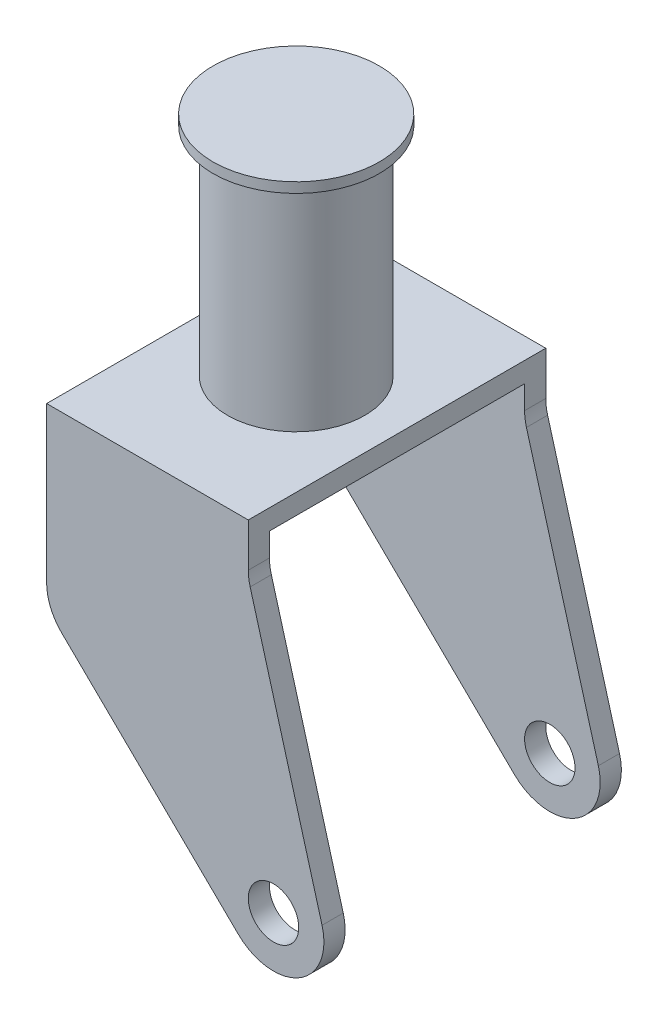
ISO-10303-21;
HEADER;
FILE_DESCRIPTION(('STEP AP214'),'2;1');
FILE_NAME('part.step','',(''),(''),'','','');
FILE_SCHEMA(('AUTOMOTIVE_DESIGN { 1 0 10303 214 1 1 1 1 }'));
ENDSEC;
DATA;
#1=APPLICATION_CONTEXT('core data for automotive mechanical design processes');
#2=APPLICATION_PROTOCOL_DEFINITION('international standard','automotive_design',2000,#1);
#3=PRODUCT_CONTEXT('',#1,'mechanical');
#4=PRODUCT('Part','Part','',(#3));
#5=PRODUCT_RELATED_PRODUCT_CATEGORY('part','',(#4));
#6=PRODUCT_DEFINITION_FORMATION('','',#4);
#7=PRODUCT_DEFINITION_CONTEXT('part definition',#1,'design');
#8=PRODUCT_DEFINITION('design','',#6,#7);
#9=PRODUCT_DEFINITION_SHAPE('','',#8);
#10=(LENGTH_UNIT() NAMED_UNIT(*) SI_UNIT(.MILLI.,.METRE.));
#11=(NAMED_UNIT(*) PLANE_ANGLE_UNIT() SI_UNIT($,.RADIAN.));
#12=(NAMED_UNIT(*) SI_UNIT($,.STERADIAN.) SOLID_ANGLE_UNIT());
#13=UNCERTAINTY_MEASURE_WITH_UNIT(LENGTH_MEASURE(1.E-05),#10,'distance_accuracy_value','');
#14=(GEOMETRIC_REPRESENTATION_CONTEXT(3) GLOBAL_UNCERTAINTY_ASSIGNED_CONTEXT((#13)) GLOBAL_UNIT_ASSIGNED_CONTEXT((#10,
#11,#12)) REPRESENTATION_CONTEXT('',''));
#15=CARTESIAN_POINT('',(0.,0.,0.));
#16=DIRECTION('',(0.,0.,1.));
#17=DIRECTION('',(1.,0.,0.));
#18=AXIS2_PLACEMENT_3D('',#15,#16,#17);
#19=CARTESIAN_POINT('',(-25.4,-39.1042861980245,-37.465));
#20=DIRECTION('',(-1.,0.,0.));
#21=DIRECTION('',(0.,0.,1.));
#22=AXIS2_PLACEMENT_3D('',#19,#20,#21);
#23=PLANE('',#22);
#24=DIRECTION('',(0.,0.,1.));
#25=VECTOR('',#24,1.);
#26=CARTESIAN_POINT('',(-25.4,-39.1042861980245,-37.465));
#27=LINE('',#26,#25);
#28=CARTESIAN_POINT('',(-25.4,-39.1042861980245,-37.465));
#29=VERTEX_POINT('',#28);
#30=CARTESIAN_POINT('',(-25.4,-39.1042861980245,-32.131));
#31=VERTEX_POINT('',#30);
#32=EDGE_CURVE('E245',#29,#31,#27,.T.);
#33=ORIENTED_EDGE('',*,*,#32,.T.);
#34=DIRECTION('',(0.,1.,0.));
#35=VECTOR('',#34,1.);
#36=CARTESIAN_POINT('',(-25.4,-39.1042861980245,-32.131));
#37=LINE('',#36,#35);
#38=CARTESIAN_POINT('',(-25.4,-5.08,-32.131));
#39=VERTEX_POINT('',#38);
#40=EDGE_CURVE('E167',#31,#39,#37,.T.);
#41=ORIENTED_EDGE('',*,*,#40,.T.);
#42=DIRECTION('',(0.,0.,1.));
#43=VECTOR('',#42,1.);
#44=CARTESIAN_POINT('',(-25.4,-5.08,-37.465));
#45=LINE('',#44,#43);
#46=CARTESIAN_POINT('',(-25.4,-5.07999999999999,32.131));
#47=VERTEX_POINT('',#46);
#48=EDGE_CURVE('E161',#39,#47,#45,.T.);
#49=ORIENTED_EDGE('',*,*,#48,.T.);
#50=DIRECTION('',(0.,-1.,0.));
#51=VECTOR('',#50,1.);
#52=CARTESIAN_POINT('',(-25.4,-39.1042861980245,32.131));
#53=LINE('',#52,#51);
#54=CARTESIAN_POINT('',(-25.4,-39.1042861980245,32.131));
#55=VERTEX_POINT('',#54);
#56=EDGE_CURVE('E147',#47,#55,#53,.T.);
#57=ORIENTED_EDGE('',*,*,#56,.T.);
#58=CARTESIAN_POINT('',(-25.4,-39.1042861980245,37.465));
#59=VERTEX_POINT('',#58);
#60=EDGE_CURVE('E220',#55,#59,#27,.T.);
#61=ORIENTED_EDGE('',*,*,#60,.T.);
#62=DIRECTION('',(0.,-1.,0.));
#63=VECTOR('',#62,1.);
#64=CARTESIAN_POINT('',(-25.4,-39.1042861980245,37.465));
#65=LINE('',#64,#63);
#66=CARTESIAN_POINT('',(-25.4,0.,37.465));
#67=VERTEX_POINT('',#66);
#68=EDGE_CURVE('E168',#67,#59,#65,.T.);
#69=ORIENTED_EDGE('',*,*,#68,.F.);
#70=DIRECTION('',(0.,0.,1.));
#71=VECTOR('',#70,1.);
#72=CARTESIAN_POINT('',(-25.4,0.,-37.465));
#73=LINE('',#72,#71);
#74=CARTESIAN_POINT('',(-25.4,0.,-37.465));
#75=VERTEX_POINT('',#74);
#76=EDGE_CURVE('E57',#75,#67,#73,.T.);
#77=ORIENTED_EDGE('',*,*,#76,.F.);
#78=DIRECTION('',(0.,-1.,0.));
#79=VECTOR('',#78,1.);
#80=CARTESIAN_POINT('',(-25.4,-39.1042861980245,-37.465));
#81=LINE('',#80,#79);
#82=EDGE_CURVE('E197',#75,#29,#81,.T.);
#83=ORIENTED_EDGE('',*,*,#82,.T.);
#84=EDGE_LOOP('',(#33,#41,#49,#57,#61,#69,#77,#83));
#85=FACE_BOUND('',#84,.T.);
#86=ADVANCED_FACE('F33',(#85),#23,.T.);
#87=CARTESIAN_POINT('',(25.4,0.,-37.465));
#88=DIRECTION('',(1.,0.,0.));
#89=DIRECTION('',(0.,1.,0.));
#90=AXIS2_PLACEMENT_3D('',#87,#88,#89);
#91=PLANE('',#90);
#92=DIRECTION('',(0.,0.,-1.));
#93=VECTOR('',#92,1.);
#94=CARTESIAN_POINT('',(25.4,-5.08,-37.465));
#95=LINE('',#94,#93);
#96=CARTESIAN_POINT('',(25.4,-5.07999999999999,32.131));
#97=VERTEX_POINT('',#96);
#98=CARTESIAN_POINT('',(25.4,-5.08,-32.131));
#99=VERTEX_POINT('',#98);
#100=EDGE_CURVE('E11',#97,#99,#95,.T.);
#101=ORIENTED_EDGE('',*,*,#100,.T.);
#102=DIRECTION('',(0.,-1.,0.));
#103=VECTOR('',#102,1.);
#104=CARTESIAN_POINT('',(25.4,0.,-32.131));
#105=LINE('',#104,#103);
#106=CARTESIAN_POINT('',(25.4,-10.9573122382427,-32.131));
#107=VERTEX_POINT('',#106);
#108=EDGE_CURVE('E173',#99,#107,#105,.T.);
#109=ORIENTED_EDGE('',*,*,#108,.T.);
#110=DIRECTION('',(0.,0.,1.));
#111=VECTOR('',#110,1.);
#112=CARTESIAN_POINT('',(25.4,-10.9573122382427,-37.465));
#113=LINE('',#112,#111);
#114=CARTESIAN_POINT('',(25.4,-10.9573122382427,-37.465));
#115=VERTEX_POINT('',#114);
#116=EDGE_CURVE('E225',#115,#107,#113,.T.);
#117=ORIENTED_EDGE('',*,*,#116,.F.);
#118=DIRECTION('',(0.,1.,0.));
#119=VECTOR('',#118,1.);
#120=CARTESIAN_POINT('',(25.4,0.,-37.465));
#121=LINE('',#120,#119);
#122=CARTESIAN_POINT('',(25.4,0.,-37.465));
#123=VERTEX_POINT('',#122);
#124=EDGE_CURVE('E214',#115,#123,#121,.T.);
#125=ORIENTED_EDGE('',*,*,#124,.T.);
#126=DIRECTION('',(0.,0.,1.));
#127=VECTOR('',#126,1.);
#128=CARTESIAN_POINT('',(25.4,0.,-37.465));
#129=LINE('',#128,#127);
#130=CARTESIAN_POINT('',(25.4,0.,37.465));
#131=VERTEX_POINT('',#130);
#132=EDGE_CURVE('E223',#123,#131,#129,.T.);
#133=ORIENTED_EDGE('',*,*,#132,.T.);
#134=DIRECTION('',(0.,1.,0.));
#135=VECTOR('',#134,1.);
#136=CARTESIAN_POINT('',(25.4,0.,37.465));
#137=LINE('',#136,#135);
#138=CARTESIAN_POINT('',(25.4,-10.9573122382427,37.465));
#139=VERTEX_POINT('',#138);
#140=EDGE_CURVE('E191',#139,#131,#137,.T.);
#141=ORIENTED_EDGE('',*,*,#140,.F.);
#142=CARTESIAN_POINT('',(25.4,-10.9573122382427,32.131));
#143=VERTEX_POINT('',#142);
#144=EDGE_CURVE('E228',#143,#139,#113,.T.);
#145=ORIENTED_EDGE('',*,*,#144,.F.);
#146=DIRECTION('',(0.,1.,0.));
#147=VECTOR('',#146,1.);
#148=CARTESIAN_POINT('',(25.4,0.,32.131));
#149=LINE('',#148,#147);
#150=EDGE_CURVE('E156',#143,#97,#149,.T.);
#151=ORIENTED_EDGE('',*,*,#150,.T.);
#152=EDGE_LOOP('',(#101,#109,#117,#125,#133,#141,#145,#151));
#153=FACE_BOUND('',#152,.T.);
#154=ADVANCED_FACE('F275',(#153),#91,.T.);
#155=CARTESIAN_POINT('',(38.1,-10.9573122382427,-37.465));
#156=DIRECTION('',(0.,0.,1.));
#157=DIRECTION('',(1.,0.,0.));
#158=AXIS2_PLACEMENT_3D('',#155,#156,#157);
#159=CYLINDRICAL_SURFACE('',#158,12.7);
#160=ORIENTED_EDGE('',*,*,#116,.T.);
#161=CARTESIAN_POINT('',(38.1,-10.9573122382427,-32.131));
#162=DIRECTION('',(0.,0.,1.));
#163=DIRECTION('',(1.,0.,0.));
#164=AXIS2_PLACEMENT_3D('',#161,#162,#163);
#165=CIRCLE('',#164,12.7);
#166=CARTESIAN_POINT('',(25.8694226670437,-14.378273813966,-32.131));
#167=VERTEX_POINT('',#166);
#168=EDGE_CURVE('E282',#107,#167,#165,.T.);
#169=ORIENTED_EDGE('',*,*,#168,.T.);
#170=DIRECTION('',(0.,0.,1.));
#171=VECTOR('',#170,1.);
#172=CARTESIAN_POINT('',(25.8694226670437,-14.378273813966,-37.465));
#173=LINE('',#172,#171);
#174=CARTESIAN_POINT('',(25.8694226670437,-14.378273813966,-37.465));
#175=VERTEX_POINT('',#174);
#176=EDGE_CURVE('E229',#175,#167,#173,.T.);
#177=ORIENTED_EDGE('',*,*,#176,.F.);
#178=CARTESIAN_POINT('',(38.1,-10.9573122382427,-37.465));
#179=DIRECTION('',(0.,0.,-1.));
#180=DIRECTION('',(1.,0.,0.));
#181=AXIS2_PLACEMENT_3D('',#178,#179,#180);
#182=CIRCLE('',#181,12.7);
#183=EDGE_CURVE('E211',#175,#115,#182,.T.);
#184=ORIENTED_EDGE('',*,*,#183,.T.);
#185=EDGE_LOOP('',(#160,#169,#177,#184));
#186=FACE_BOUND('',#185,.T.);
#187=ADVANCED_FACE('F280',(#186),#159,.F.);
#188=CARTESIAN_POINT('',(25.8694226670437,-14.378273813966,32.131));
#189=VERTEX_POINT('',#188);
#190=CARTESIAN_POINT('',(25.8694226670437,-14.378273813966,37.465));
#191=VERTEX_POINT('',#190);
#192=EDGE_CURVE('E232',#189,#191,#173,.T.);
#193=ORIENTED_EDGE('',*,*,#192,.F.);
#194=CARTESIAN_POINT('',(38.1,-10.9573122382427,32.131));
#195=DIRECTION('',(0.,0.,-1.));
#196=DIRECTION('',(0.,1.,0.));
#197=AXIS2_PLACEMENT_3D('',#194,#195,#196);
#198=CIRCLE('',#197,12.7);
#199=EDGE_CURVE('E314',#189,#143,#198,.T.);
#200=ORIENTED_EDGE('',*,*,#199,.T.);
#201=ORIENTED_EDGE('',*,*,#144,.T.);
#202=CARTESIAN_POINT('',(38.1,-10.9573122382427,37.465));
#203=DIRECTION('',(0.,0.,-1.));
#204=DIRECTION('',(1.,0.,0.));
#205=AXIS2_PLACEMENT_3D('',#202,#203,#204);
#206=CIRCLE('',#205,12.7);
#207=EDGE_CURVE('E188',#191,#139,#206,.T.);
#208=ORIENTED_EDGE('',*,*,#207,.F.);
#209=EDGE_LOOP('',(#193,#200,#201,#208));
#210=FACE_BOUND('',#209,.T.);
#211=ADVANCED_FACE('F319',(#210),#159,.F.);
#212=CARTESIAN_POINT('',(25.8694226670437,-14.378273813966,-37.465));
#213=DIRECTION('',(0.963037585272151,0.269367053206559,0.));
#214=DIRECTION('',(-0.269367053206559,0.963037585272151,0.));
#215=AXIS2_PLACEMENT_3D('',#212,#213,#214);
#216=PLANE('',#215);
#217=ORIENTED_EDGE('',*,*,#176,.T.);
#218=DIRECTION('',(0.269367053206559,-0.963037585272151,0.));
#219=VECTOR('',#218,1.);
#220=CARTESIAN_POINT('',(25.8694226670437,-14.378273813966,-32.131));
#221=LINE('',#220,#219);
#222=CARTESIAN_POINT('',(43.9805773329564,-79.1290384242767,-32.131));
#223=VERTEX_POINT('',#222);
#224=EDGE_CURVE('E286',#167,#223,#221,.T.);
#225=ORIENTED_EDGE('',*,*,#224,.T.);
#226=DIRECTION('',(0.,0.,1.));
#227=VECTOR('',#226,1.);
#228=CARTESIAN_POINT('',(43.9805773329564,-79.1290384242767,-37.465));
#229=LINE('',#228,#227);
#230=CARTESIAN_POINT('',(43.9805773329564,-79.1290384242767,-37.465));
#231=VERTEX_POINT('',#230);
#232=EDGE_CURVE('E233',#231,#223,#229,.T.);
#233=ORIENTED_EDGE('',*,*,#232,.F.);
#234=DIRECTION('',(-0.269367053206559,0.963037585272151,0.));
#235=VECTOR('',#234,1.);
#236=CARTESIAN_POINT('',(25.8694226670437,-14.378273813966,-37.465));
#237=LINE('',#236,#235);
#238=EDGE_CURVE('E208',#231,#175,#237,.T.);
#239=ORIENTED_EDGE('',*,*,#238,.T.);
#240=EDGE_LOOP('',(#217,#225,#233,#239));
#241=FACE_BOUND('',#240,.T.);
#242=ADVANCED_FACE('F285',(#241),#216,.T.);
#243=CARTESIAN_POINT('',(43.9805773329564,-79.1290384242767,32.131));
#244=VERTEX_POINT('',#243);
#245=CARTESIAN_POINT('',(43.9805773329564,-79.1290384242767,37.465));
#246=VERTEX_POINT('',#245);
#247=EDGE_CURVE('E236',#244,#246,#229,.T.);
#248=ORIENTED_EDGE('',*,*,#247,.F.);
#249=DIRECTION('',(-0.269367053206559,0.963037585272151,0.));
#250=VECTOR('',#249,1.);
#251=CARTESIAN_POINT('',(25.8694226670437,-14.3782738139661,32.131));
#252=LINE('',#251,#250);
#253=EDGE_CURVE('E311',#244,#189,#252,.T.);
#254=ORIENTED_EDGE('',*,*,#253,.T.);
#255=ORIENTED_EDGE('',*,*,#192,.T.);
#256=DIRECTION('',(-0.269367053206559,0.963037585272151,0.));
#257=VECTOR('',#256,1.);
#258=CARTESIAN_POINT('',(25.8694226670437,-14.378273813966,37.465));
#259=LINE('',#258,#257);
#260=EDGE_CURVE('E185',#246,#191,#259,.T.);
#261=ORIENTED_EDGE('',*,*,#260,.F.);
#262=EDGE_LOOP('',(#248,#254,#255,#261));
#263=FACE_BOUND('',#262,.T.);
#264=ADVANCED_FACE('F324',(#263),#216,.T.);
#265=CARTESIAN_POINT('',(31.75,-82.55,-37.465));
#266=DIRECTION('',(0.,0.,1.));
#267=DIRECTION('',(1.,0.,0.));
#268=AXIS2_PLACEMENT_3D('',#265,#266,#267);
#269=CYLINDRICAL_SURFACE('',#268,12.7);
#270=ORIENTED_EDGE('',*,*,#232,.T.);
#271=CARTESIAN_POINT('',(31.75,-82.55,-32.131));
#272=DIRECTION('',(0.,0.,1.));
#273=DIRECTION('',(1.,0.,0.));
#274=AXIS2_PLACEMENT_3D('',#271,#272,#273);
#275=CIRCLE('',#274,12.7);
#276=CARTESIAN_POINT('',(22.8729306758087,-91.6322706529536,-32.131));
#277=VERTEX_POINT('',#276);
#278=EDGE_CURVE('E291',#223,#277,#275,.F.);
#279=ORIENTED_EDGE('',*,*,#278,.T.);
#280=DIRECTION('',(0.,0.,1.));
#281=VECTOR('',#280,1.);
#282=CARTESIAN_POINT('',(22.8729306758087,-91.6322706529536,-37.465));
#283=LINE('',#282,#281);
#284=CARTESIAN_POINT('',(22.8729306758087,-91.6322706529536,-37.465));
#285=VERTEX_POINT('',#284);
#286=EDGE_CURVE('E237',#285,#277,#283,.T.);
#287=ORIENTED_EDGE('',*,*,#286,.F.);
#288=CARTESIAN_POINT('',(31.75,-82.55,-37.465));
#289=DIRECTION('',(0.,0.,1.));
#290=DIRECTION('',(-1.,0.,0.));
#291=AXIS2_PLACEMENT_3D('',#288,#289,#290);
#292=CIRCLE('',#291,12.7);
#293=EDGE_CURVE('E205',#285,#231,#292,.T.);
#294=ORIENTED_EDGE('',*,*,#293,.T.);
#295=EDGE_LOOP('',(#270,#279,#287,#294));
#296=FACE_BOUND('',#295,.T.);
#297=ADVANCED_FACE('F289',(#296),#269,.T.);
#298=CARTESIAN_POINT('',(22.8729306758087,-91.6322706529536,32.131));
#299=VERTEX_POINT('',#298);
#300=CARTESIAN_POINT('',(22.8729306758087,-91.6322706529536,37.465));
#301=VERTEX_POINT('',#300);
#302=EDGE_CURVE('E240',#299,#301,#283,.T.);
#303=ORIENTED_EDGE('',*,*,#302,.F.);
#304=CARTESIAN_POINT('',(31.75,-82.55,32.131));
#305=DIRECTION('',(0.,0.,-1.));
#306=DIRECTION('',(0.,1.,0.));
#307=AXIS2_PLACEMENT_3D('',#304,#305,#306);
#308=CIRCLE('',#307,12.7);
#309=EDGE_CURVE('E308',#299,#244,#308,.F.);
#310=ORIENTED_EDGE('',*,*,#309,.T.);
#311=ORIENTED_EDGE('',*,*,#247,.T.);
#312=CARTESIAN_POINT('',(31.75,-82.55,37.465));
#313=DIRECTION('',(0.,0.,1.));
#314=DIRECTION('',(-1.,0.,0.));
#315=AXIS2_PLACEMENT_3D('',#312,#313,#314);
#316=CIRCLE('',#315,12.7);
#317=EDGE_CURVE('E182',#301,#246,#316,.T.);
#318=ORIENTED_EDGE('',*,*,#317,.F.);
#319=EDGE_LOOP('',(#303,#310,#311,#318));
#320=FACE_BOUND('',#319,.T.);
#321=ADVANCED_FACE('F331',(#320),#269,.T.);
#322=CARTESIAN_POINT('',(22.8729306758087,-91.6322706529536,-37.465));
#323=DIRECTION('',(-0.698981836550495,-0.715139421492409,0.));
#324=DIRECTION('',(0.715139421492409,-0.698981836550495,0.));
#325=AXIS2_PLACEMENT_3D('',#322,#323,#324);
#326=PLANE('',#325);
#327=ORIENTED_EDGE('',*,*,#286,.T.);
#328=DIRECTION('',(-0.715139421492409,0.698981836550495,0.));
#329=VECTOR('',#328,1.);
#330=CARTESIAN_POINT('',(22.8729306758087,-91.6322706529536,-32.131));
#331=LINE('',#330,#329);
#332=CARTESIAN_POINT('',(-21.5770693241913,-48.1865568509781,-32.131));
#333=VERTEX_POINT('',#332);
#334=EDGE_CURVE('E155',#277,#333,#331,.T.);
#335=ORIENTED_EDGE('',*,*,#334,.T.);
#336=DIRECTION('',(0.,0.,1.));
#337=VECTOR('',#336,1.);
#338=CARTESIAN_POINT('',(-21.5770693241913,-48.1865568509781,-37.465));
#339=LINE('',#338,#337);
#340=CARTESIAN_POINT('',(-21.5770693241913,-48.1865568509781,-37.465));
#341=VERTEX_POINT('',#340);
#342=EDGE_CURVE('E241',#341,#333,#339,.T.);
#343=ORIENTED_EDGE('',*,*,#342,.F.);
#344=DIRECTION('',(0.715139421492409,-0.698981836550495,0.));
#345=VECTOR('',#344,1.);
#346=CARTESIAN_POINT('',(22.8729306758087,-91.6322706529536,-37.465));
#347=LINE('',#346,#345);
#348=EDGE_CURVE('E202',#341,#285,#347,.T.);
#349=ORIENTED_EDGE('',*,*,#348,.T.);
#350=EDGE_LOOP('',(#327,#335,#343,#349));
#351=FACE_BOUND('',#350,.T.);
#352=ADVANCED_FACE('F293',(#351),#326,.T.);
#353=CARTESIAN_POINT('',(-21.5770693241913,-48.1865568509781,32.131));
#354=VERTEX_POINT('',#353);
#355=CARTESIAN_POINT('',(-21.5770693241913,-48.1865568509781,37.465));
#356=VERTEX_POINT('',#355);
#357=EDGE_CURVE('E244',#354,#356,#339,.T.);
#358=ORIENTED_EDGE('',*,*,#357,.F.);
#359=DIRECTION('',(0.715139421492409,-0.698981836550495,0.));
#360=VECTOR('',#359,1.);
#361=CARTESIAN_POINT('',(22.8729306758087,-91.6322706529536,32.131));
#362=LINE('',#361,#360);
#363=EDGE_CURVE('E49',#354,#299,#362,.T.);
#364=ORIENTED_EDGE('',*,*,#363,.T.);
#365=ORIENTED_EDGE('',*,*,#302,.T.);
#366=DIRECTION('',(0.715139421492409,-0.698981836550495,0.));
#367=VECTOR('',#366,1.);
#368=CARTESIAN_POINT('',(22.8729306758087,-91.6322706529536,37.465));
#369=LINE('',#368,#367);
#370=EDGE_CURVE('E179',#356,#301,#369,.T.);
#371=ORIENTED_EDGE('',*,*,#370,.F.);
#372=EDGE_LOOP('',(#358,#364,#365,#371));
#373=FACE_BOUND('',#372,.T.);
#374=ADVANCED_FACE('F334',(#373),#326,.T.);
#375=CARTESIAN_POINT('',(-12.7,-39.1042861980245,-37.465));
#376=DIRECTION('',(0.,0.,1.));
#377=DIRECTION('',(1.,0.,0.));
#378=AXIS2_PLACEMENT_3D('',#375,#376,#377);
#379=CYLINDRICAL_SURFACE('',#378,12.7);
#380=ORIENTED_EDGE('',*,*,#342,.T.);
#381=CARTESIAN_POINT('',(-12.7,-39.1042861980245,-32.131));
#382=DIRECTION('',(0.,0.,1.));
#383=DIRECTION('',(1.,0.,0.));
#384=AXIS2_PLACEMENT_3D('',#381,#382,#383);
#385=CIRCLE('',#384,12.7);
#386=EDGE_CURVE('E42',#333,#31,#385,.F.);
#387=ORIENTED_EDGE('',*,*,#386,.T.);
#388=ORIENTED_EDGE('',*,*,#32,.F.);
#389=CARTESIAN_POINT('',(-12.7,-39.1042861980245,-37.465));
#390=DIRECTION('',(0.,0.,1.));
#391=DIRECTION('',(-1.,0.,0.));
#392=AXIS2_PLACEMENT_3D('',#389,#390,#391);
#393=CIRCLE('',#392,12.7);
#394=EDGE_CURVE('E199',#29,#341,#393,.T.);
#395=ORIENTED_EDGE('',*,*,#394,.T.);
#396=EDGE_LOOP('',(#380,#387,#388,#395));
#397=FACE_BOUND('',#396,.T.);
#398=ADVANCED_FACE('F261',(#397),#379,.T.);
#399=ORIENTED_EDGE('',*,*,#60,.F.);
#400=CARTESIAN_POINT('',(-12.7,-39.1042861980245,32.131));
#401=DIRECTION('',(0.,0.,-1.));
#402=DIRECTION('',(0.,1.,0.));
#403=AXIS2_PLACEMENT_3D('',#400,#401,#402);
#404=CIRCLE('',#403,12.7);
#405=EDGE_CURVE('E152',#55,#354,#404,.F.);
#406=ORIENTED_EDGE('',*,*,#405,.T.);
#407=ORIENTED_EDGE('',*,*,#357,.T.);
#408=CARTESIAN_POINT('',(-12.7,-39.1042861980245,37.465));
#409=DIRECTION('',(0.,0.,1.));
#410=DIRECTION('',(-1.,0.,0.));
#411=AXIS2_PLACEMENT_3D('',#408,#409,#410);
#412=CIRCLE('',#411,12.7);
#413=EDGE_CURVE('E171',#59,#356,#412,.T.);
#414=ORIENTED_EDGE('',*,*,#413,.F.);
#415=EDGE_LOOP('',(#399,#406,#407,#414));
#416=FACE_BOUND('',#415,.T.);
#417=ADVANCED_FACE('F337',(#416),#379,.T.);
#418=CARTESIAN_POINT('',(0.,57.15,0.));
#419=DIRECTION('',(0.,-1.,0.));
#420=DIRECTION('',(0.,0.,-1.));
#421=AXIS2_PLACEMENT_3D('',#418,#419,#420);
#422=PLANE('',#421);
#423=CARTESIAN_POINT('',(0.,57.15,0.));
#424=DIRECTION('',(0.,1.,0.));
#425=DIRECTION('',(0.,0.,1.));
#426=AXIS2_PLACEMENT_3D('',#423,#424,#425);
#427=CIRCLE('',#426,20.955);
#428=CARTESIAN_POINT('',(0.,57.15,20.955));
#429=VERTEX_POINT('',#428);
#430=EDGE_CURVE('E255',#429,#429,#427,.T.);
#431=ORIENTED_EDGE('',*,*,#430,.T.);
#432=EDGE_LOOP('',(#431));
#433=FACE_BOUND('',#432,.T.);
#434=ADVANCED_FACE('F35',(#433),#422,.F.);
#435=CARTESIAN_POINT('',(0.,38.1873125,0.));
#436=DIRECTION('',(0.,1.,0.));
#437=DIRECTION('',(0.,0.,1.));
#438=AXIS2_PLACEMENT_3D('',#435,#436,#437);
#439=CYLINDRICAL_SURFACE('',#438,20.955);
#440=ORIENTED_EDGE('',*,*,#430,.F.);
#441=EDGE_LOOP('',(#440));
#442=FACE_BOUND('',#441,.T.);
#443=CARTESIAN_POINT('',(0.,54.61,0.));
#444=DIRECTION('',(0.,1.,0.));
#445=DIRECTION('',(0.,0.,1.));
#446=AXIS2_PLACEMENT_3D('',#443,#444,#445);
#447=CIRCLE('',#446,20.955);
#448=CARTESIAN_POINT('',(0.,54.61,20.955));
#449=VERTEX_POINT('',#448);
#450=EDGE_CURVE('E252',#449,#449,#447,.T.);
#451=ORIENTED_EDGE('',*,*,#450,.T.);
#452=EDGE_LOOP('',(#451));
#453=FACE_BOUND('',#452,.T.);
#454=ADVANCED_FACE('F344',(#442,#453),#439,.T.);
#455=CARTESIAN_POINT('',(20.955,54.61,0.));
#456=DIRECTION('',(0.,1.,0.));
#457=DIRECTION('',(0.,0.,1.));
#458=AXIS2_PLACEMENT_3D('',#455,#456,#457);
#459=PLANE('',#458);
#460=ORIENTED_EDGE('',*,*,#450,.F.);
#461=EDGE_LOOP('',(#460));
#462=FACE_BOUND('',#461,.T.);
#463=CARTESIAN_POINT('',(0.,54.61,0.));
#464=DIRECTION('',(0.,1.,0.));
#465=DIRECTION('',(0.,0.,1.));
#466=AXIS2_PLACEMENT_3D('',#463,#464,#465);
#467=CIRCLE('',#466,17.272);
#468=CARTESIAN_POINT('',(0.,54.61,17.272));
#469=VERTEX_POINT('',#468);
#470=EDGE_CURVE('E249',#469,#469,#467,.T.);
#471=ORIENTED_EDGE('',*,*,#470,.T.);
#472=EDGE_LOOP('',(#471));
#473=FACE_BOUND('',#472,.T.);
#474=ADVANCED_FACE('F357',(#462,#473),#459,.F.);
#475=CARTESIAN_POINT('',(0.,38.1873125,0.));
#476=DIRECTION('',(0.,1.,0.));
#477=DIRECTION('',(0.,0.,1.));
#478=AXIS2_PLACEMENT_3D('',#475,#476,#477);
#479=CYLINDRICAL_SURFACE('',#478,17.272);
#480=ORIENTED_EDGE('',*,*,#470,.F.);
#481=EDGE_LOOP('',(#480));
#482=FACE_BOUND('',#481,.T.);
#483=CARTESIAN_POINT('',(0.,0.,0.));
#484=DIRECTION('',(0.,1.,0.));
#485=DIRECTION('',(-1.,0.,0.));
#486=AXIS2_PLACEMENT_3D('',#483,#484,#485);
#487=CIRCLE('',#486,17.272);
#488=CARTESIAN_POINT('',(-17.272,0.,0.));
#489=VERTEX_POINT('',#488);
#490=EDGE_CURVE('E222',#489,#489,#487,.T.);
#491=ORIENTED_EDGE('',*,*,#490,.T.);
#492=EDGE_LOOP('',(#491));
#493=FACE_BOUND('',#492,.T.);
#494=ADVANCED_FACE('F354',(#482,#493),#479,.T.);
#495=CARTESIAN_POINT('',(-25.4,0.,-37.465));
#496=DIRECTION('',(0.,1.,0.));
#497=DIRECTION('',(-1.,0.,0.));
#498=AXIS2_PLACEMENT_3D('',#495,#496,#497);
#499=PLANE('',#498);
#500=ORIENTED_EDGE('',*,*,#490,.F.);
#501=EDGE_LOOP('',(#500));
#502=FACE_BOUND('',#501,.T.);
#503=ORIENTED_EDGE('',*,*,#76,.T.);
#504=DIRECTION('',(-1.,0.,0.));
#505=VECTOR('',#504,1.);
#506=CARTESIAN_POINT('',(-25.4,0.,37.465));
#507=LINE('',#506,#505);
#508=EDGE_CURVE('E194',#131,#67,#507,.T.);
#509=ORIENTED_EDGE('',*,*,#508,.F.);
#510=ORIENTED_EDGE('',*,*,#132,.F.);
#511=DIRECTION('',(-1.,0.,0.));
#512=VECTOR('',#511,1.);
#513=CARTESIAN_POINT('',(-25.4,0.,-37.465));
#514=LINE('',#513,#512);
#515=EDGE_CURVE('E217',#123,#75,#514,.T.);
#516=ORIENTED_EDGE('',*,*,#515,.T.);
#517=EDGE_LOOP('',(#503,#509,#510,#516));
#518=FACE_BOUND('',#517,.T.);
#519=ADVANCED_FACE('F271',(#502,#518),#499,.T.);
#520=CARTESIAN_POINT('',(38.1,-10.9573122382427,-37.465));
#521=DIRECTION('',(0.,0.,1.));
#522=DIRECTION('',(1.,0.,0.));
#523=AXIS2_PLACEMENT_3D('',#520,#521,#522);
#524=PLANE('',#523);
#525=CARTESIAN_POINT('',(31.75,-82.55,-37.465));
#526=DIRECTION('',(0.,0.,1.));
#527=DIRECTION('',(1.,0.,0.));
#528=AXIS2_PLACEMENT_3D('',#525,#526,#527);
#529=CIRCLE('',#528,6.35);
#530=CARTESIAN_POINT('',(38.1,-82.55,-37.465));
#531=VERTEX_POINT('',#530);
#532=EDGE_CURVE('E300',#531,#531,#529,.T.);
#533=ORIENTED_EDGE('',*,*,#532,.T.);
#534=EDGE_LOOP('',(#533));
#535=FACE_BOUND('',#534,.T.);
#536=ORIENTED_EDGE('',*,*,#82,.F.);
#537=ORIENTED_EDGE('',*,*,#515,.F.);
#538=ORIENTED_EDGE('',*,*,#124,.F.);
#539=ORIENTED_EDGE('',*,*,#183,.F.);
#540=ORIENTED_EDGE('',*,*,#238,.F.);
#541=ORIENTED_EDGE('',*,*,#293,.F.);
#542=ORIENTED_EDGE('',*,*,#348,.F.);
#543=ORIENTED_EDGE('',*,*,#394,.F.);
#544=EDGE_LOOP('',(#536,#537,#538,#539,#540,#541,#542,#543));
#545=FACE_BOUND('',#544,.T.);
#546=ADVANCED_FACE('F267',(#535,#545),#524,.F.);
#547=CARTESIAN_POINT('',(38.1,-10.9573122382427,37.465));
#548=DIRECTION('',(0.,0.,1.));
#549=DIRECTION('',(1.,0.,0.));
#550=AXIS2_PLACEMENT_3D('',#547,#548,#549);
#551=PLANE('',#550);
#552=CARTESIAN_POINT('',(31.75,-82.55,37.465));
#553=DIRECTION('',(0.,0.,1.));
#554=DIRECTION('',(1.,0.,0.));
#555=AXIS2_PLACEMENT_3D('',#552,#553,#554);
#556=CIRCLE('',#555,6.35);
#557=CARTESIAN_POINT('',(38.1,-82.55,37.465));
#558=VERTEX_POINT('',#557);
#559=EDGE_CURVE('E541',#558,#558,#556,.T.);
#560=ORIENTED_EDGE('',*,*,#559,.F.);
#561=EDGE_LOOP('',(#560));
#562=FACE_BOUND('',#561,.T.);
#563=ORIENTED_EDGE('',*,*,#68,.T.);
#564=ORIENTED_EDGE('',*,*,#413,.T.);
#565=ORIENTED_EDGE('',*,*,#370,.T.);
#566=ORIENTED_EDGE('',*,*,#317,.T.);
#567=ORIENTED_EDGE('',*,*,#260,.T.);
#568=ORIENTED_EDGE('',*,*,#207,.T.);
#569=ORIENTED_EDGE('',*,*,#140,.T.);
#570=ORIENTED_EDGE('',*,*,#508,.T.);
#571=EDGE_LOOP('',(#563,#564,#565,#566,#567,#568,#569,#570));
#572=FACE_BOUND('',#571,.T.);
#573=ADVANCED_FACE('F326',(#562,#572),#551,.T.);
#574=CARTESIAN_POINT('',(-80.518,-5.08,-32.131));
#575=DIRECTION('',(0.,0.,1.));
#576=DIRECTION('',(1.,0.,0.));
#577=AXIS2_PLACEMENT_3D('',#574,#575,#576);
#578=PLANE('',#577);
#579=CARTESIAN_POINT('',(31.75,-82.55,-32.131));
#580=DIRECTION('',(0.,0.,1.));
#581=DIRECTION('',(1.,0.,0.));
#582=AXIS2_PLACEMENT_3D('',#579,#580,#581);
#583=CIRCLE('',#582,6.35);
#584=CARTESIAN_POINT('',(38.1,-82.55,-32.131));
#585=VERTEX_POINT('',#584);
#586=EDGE_CURVE('E303',#585,#585,#583,.T.);
#587=ORIENTED_EDGE('',*,*,#586,.F.);
#588=EDGE_LOOP('',(#587));
#589=FACE_BOUND('',#588,.T.);
#590=ORIENTED_EDGE('',*,*,#386,.F.);
#591=ORIENTED_EDGE('',*,*,#334,.F.);
#592=ORIENTED_EDGE('',*,*,#278,.F.);
#593=ORIENTED_EDGE('',*,*,#224,.F.);
#594=ORIENTED_EDGE('',*,*,#168,.F.);
#595=ORIENTED_EDGE('',*,*,#108,.F.);
#596=DIRECTION('',(1.,0.,0.));
#597=VECTOR('',#596,1.);
#598=CARTESIAN_POINT('',(-80.518,-5.08,-32.131));
#599=LINE('',#598,#597);
#600=EDGE_CURVE('E163',#39,#99,#599,.T.);
#601=ORIENTED_EDGE('',*,*,#600,.F.);
#602=ORIENTED_EDGE('',*,*,#40,.F.);
#603=EDGE_LOOP('',(#590,#591,#592,#593,#594,#595,#601,#602));
#604=FACE_BOUND('',#603,.T.);
#605=ADVANCED_FACE('F299',(#589,#604),#578,.T.);
#606=CARTESIAN_POINT('',(-80.518,-5.07999999999999,32.131));
#607=DIRECTION('',(0.,0.,-1.));
#608=DIRECTION('',(0.,1.,0.));
#609=AXIS2_PLACEMENT_3D('',#606,#607,#608);
#610=PLANE('',#609);
#611=CARTESIAN_POINT('',(31.75,-82.55,32.131));
#612=DIRECTION('',(0.,0.,-1.));
#613=DIRECTION('',(0.,1.,0.));
#614=AXIS2_PLACEMENT_3D('',#611,#612,#613);
#615=CIRCLE('',#614,6.35);
#616=CARTESIAN_POINT('',(31.75,-76.2,32.131));
#617=VERTEX_POINT('',#616);
#618=EDGE_CURVE('E37',#617,#617,#615,.T.);
#619=ORIENTED_EDGE('',*,*,#618,.F.);
#620=EDGE_LOOP('',(#619));
#621=FACE_BOUND('',#620,.T.);
#622=DIRECTION('',(1.,0.,0.));
#623=VECTOR('',#622,1.);
#624=CARTESIAN_POINT('',(-80.518,-5.07999999999999,32.131));
#625=LINE('',#624,#623);
#626=EDGE_CURVE('E150',#47,#97,#625,.T.);
#627=ORIENTED_EDGE('',*,*,#626,.T.);
#628=ORIENTED_EDGE('',*,*,#150,.F.);
#629=ORIENTED_EDGE('',*,*,#199,.F.);
#630=ORIENTED_EDGE('',*,*,#253,.F.);
#631=ORIENTED_EDGE('',*,*,#309,.F.);
#632=ORIENTED_EDGE('',*,*,#363,.F.);
#633=ORIENTED_EDGE('',*,*,#405,.F.);
#634=ORIENTED_EDGE('',*,*,#56,.F.);
#635=EDGE_LOOP('',(#627,#628,#629,#630,#631,#632,#633,#634));
#636=FACE_BOUND('',#635,.T.);
#637=ADVANCED_FACE('F149',(#621,#636),#610,.T.);
#638=CARTESIAN_POINT('',(-80.518,-5.08,-32.131));
#639=DIRECTION('',(0.,-1.,0.));
#640=DIRECTION('',(0.,0.,-1.));
#641=AXIS2_PLACEMENT_3D('',#638,#639,#640);
#642=PLANE('',#641);
#643=ORIENTED_EDGE('',*,*,#600,.T.);
#644=ORIENTED_EDGE('',*,*,#100,.F.);
#645=ORIENTED_EDGE('',*,*,#626,.F.);
#646=ORIENTED_EDGE('',*,*,#48,.F.);
#647=EDGE_LOOP('',(#643,#644,#645,#646));
#648=FACE_BOUND('',#647,.T.);
#649=ADVANCED_FACE('F160',(#648),#642,.T.);
#650=CARTESIAN_POINT('',(31.75,-82.55,-72.136));
#651=DIRECTION('',(0.,0.,1.));
#652=DIRECTION('',(1.,0.,0.));
#653=AXIS2_PLACEMENT_3D('',#650,#651,#652);
#654=CYLINDRICAL_SURFACE('',#653,6.35);
#655=ORIENTED_EDGE('',*,*,#618,.T.);
#656=EDGE_LOOP('',(#655));
#657=FACE_BOUND('',#656,.T.);
#658=ORIENTED_EDGE('',*,*,#559,.T.);
#659=EDGE_LOOP('',(#658));
#660=FACE_BOUND('',#659,.T.);
#661=ADVANCED_FACE('F504',(#657,#660),#654,.F.);
#662=ORIENTED_EDGE('',*,*,#586,.T.);
#663=EDGE_LOOP('',(#662));
#664=FACE_BOUND('',#663,.T.);
#665=ORIENTED_EDGE('',*,*,#532,.F.);
#666=EDGE_LOOP('',(#665));
#667=FACE_BOUND('',#666,.T.);
#668=ADVANCED_FACE('F519',(#664,#667),#654,.F.);
#669=CLOSED_SHELL('',(#86,#154,#187,#211,#242,#264,#297,#321,#352,#374,#398,#417,#434,#454,#474,
#494,#519,#546,#573,#605,#637,#649,#661,#668));
#670=MANIFOLD_SOLID_BREP('B2',#669);
#671=ADVANCED_BREP_SHAPE_REPRESENTATION('',(#18,#670),#14);
#672=SHAPE_DEFINITION_REPRESENTATION(#9,#671);
ENDSEC;
END-ISO-10303-21;
